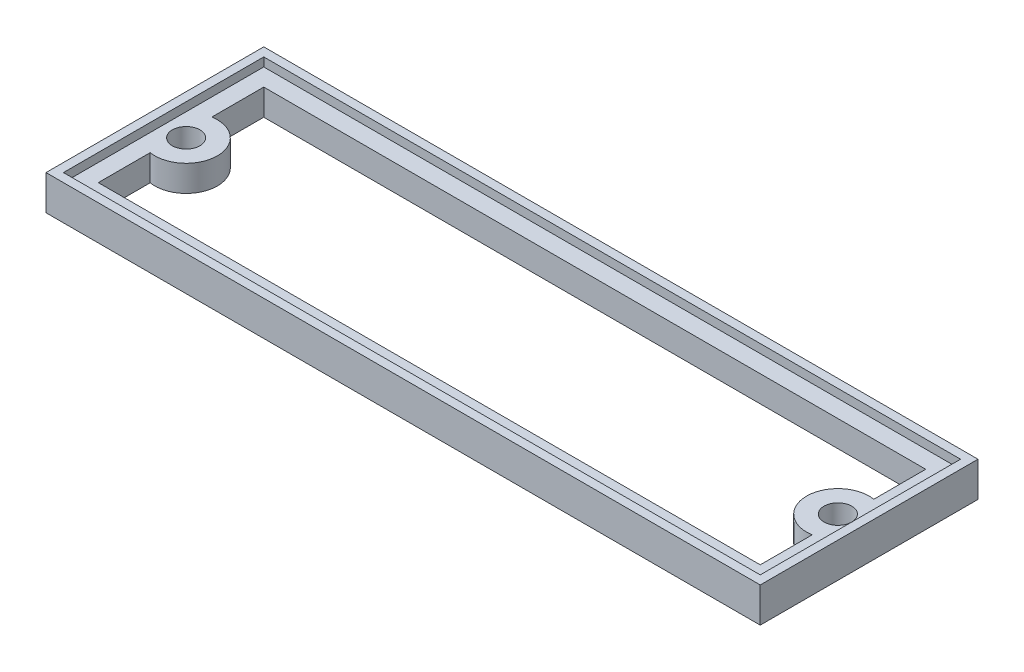
ISO-10303-21;
HEADER;
FILE_DESCRIPTION(('STEP AP214'),'2;1');
FILE_NAME('part.step','',(''),(''),'','','');
FILE_SCHEMA(('AUTOMOTIVE_DESIGN { 1 0 10303 214 1 1 1 1 }'));
ENDSEC;
DATA;
#1=APPLICATION_CONTEXT('core data for automotive mechanical design processes');
#2=APPLICATION_PROTOCOL_DEFINITION('international standard','automotive_design',2000,#1);
#3=PRODUCT_CONTEXT('',#1,'mechanical');
#4=PRODUCT('Part','Part','',(#3));
#5=PRODUCT_RELATED_PRODUCT_CATEGORY('part','',(#4));
#6=PRODUCT_DEFINITION_FORMATION('','',#4);
#7=PRODUCT_DEFINITION_CONTEXT('part definition',#1,'design');
#8=PRODUCT_DEFINITION('design','',#6,#7);
#9=PRODUCT_DEFINITION_SHAPE('','',#8);
#10=(LENGTH_UNIT() NAMED_UNIT(*) SI_UNIT(.MILLI.,.METRE.));
#11=(NAMED_UNIT(*) PLANE_ANGLE_UNIT() SI_UNIT($,.RADIAN.));
#12=(NAMED_UNIT(*) SI_UNIT($,.STERADIAN.) SOLID_ANGLE_UNIT());
#13=UNCERTAINTY_MEASURE_WITH_UNIT(LENGTH_MEASURE(1.E-05),#10,'distance_accuracy_value','');
#14=(GEOMETRIC_REPRESENTATION_CONTEXT(3) GLOBAL_UNCERTAINTY_ASSIGNED_CONTEXT((#13)) GLOBAL_UNIT_ASSIGNED_CONTEXT((#10,
#11,#12)) REPRESENTATION_CONTEXT('',''));
#15=CARTESIAN_POINT('',(0.,0.,0.));
#16=DIRECTION('',(0.,0.,1.));
#17=DIRECTION('',(1.,0.,0.));
#18=AXIS2_PLACEMENT_3D('',#15,#16,#17);
#19=CARTESIAN_POINT('',(2.58750000000001,3.,-11.5));
#20=DIRECTION('',(0.,-1.,0.));
#21=DIRECTION('',(0.,0.,-1.));
#22=AXIS2_PLACEMENT_3D('',#19,#20,#21);
#23=CYLINDRICAL_SURFACE('',#22,3.58750000000001);
#24=CARTESIAN_POINT('',(2.58750000000001,0.,-11.5));
#25=DIRECTION('',(0.,1.,0.));
#26=DIRECTION('',(0.,0.,1.));
#27=AXIS2_PLACEMENT_3D('',#24,#25,#26);
#28=CIRCLE('',#27,3.58750000000001);
#29=CARTESIAN_POINT('',(2.,0.,-15.0390676738373));
#30=VERTEX_POINT('',#29);
#31=CARTESIAN_POINT('',(2.,0.,-7.96093232616271));
#32=VERTEX_POINT('',#31);
#33=EDGE_CURVE('E144',#30,#32,#28,.F.);
#34=ORIENTED_EDGE('',*,*,#33,.F.);
#35=DIRECTION('',(0.,-1.,0.));
#36=VECTOR('',#35,1.);
#37=CARTESIAN_POINT('',(2.,3.,-15.0390676738373));
#38=LINE('',#37,#36);
#39=CARTESIAN_POINT('',(2.,3.,-15.0390676738373));
#40=VERTEX_POINT('',#39);
#41=EDGE_CURVE('E11',#40,#30,#38,.T.);
#42=ORIENTED_EDGE('',*,*,#41,.F.);
#43=CARTESIAN_POINT('',(2.58750000000001,3.,-11.5));
#44=DIRECTION('',(0.,1.,0.));
#45=DIRECTION('',(0.,0.,1.));
#46=AXIS2_PLACEMENT_3D('',#43,#44,#45);
#47=CIRCLE('',#46,3.58750000000001);
#48=CARTESIAN_POINT('',(2.,3.,-7.96093232616271));
#49=VERTEX_POINT('',#48);
#50=EDGE_CURVE('E167',#40,#49,#47,.F.);
#51=ORIENTED_EDGE('',*,*,#50,.T.);
#52=DIRECTION('',(0.,-1.,0.));
#53=VECTOR('',#52,1.);
#54=CARTESIAN_POINT('',(2.,3.,-7.96093232616271));
#55=LINE('',#54,#53);
#56=EDGE_CURVE('E87',#49,#32,#55,.T.);
#57=ORIENTED_EDGE('',*,*,#56,.T.);
#58=EDGE_LOOP('',(#34,#42,#51,#57));
#59=FACE_BOUND('',#58,.T.);
#60=ADVANCED_FACE('F34',(#59),#23,.T.);
#61=CARTESIAN_POINT('',(2.,3.,0.));
#62=DIRECTION('',(-1.,0.,0.));
#63=DIRECTION('',(0.,0.,1.));
#64=AXIS2_PLACEMENT_3D('',#61,#62,#63);
#65=PLANE('',#64);
#66=DIRECTION('',(0.,0.,-1.));
#67=VECTOR('',#66,1.);
#68=CARTESIAN_POINT('',(2.,0.,0.));
#69=LINE('',#68,#67);
#70=CARTESIAN_POINT('',(2.,0.,-21.));
#71=VERTEX_POINT('',#70);
#72=EDGE_CURVE('E148',#30,#71,#69,.T.);
#73=ORIENTED_EDGE('',*,*,#72,.T.);
#74=DIRECTION('',(0.,-1.,0.));
#75=VECTOR('',#74,1.);
#76=CARTESIAN_POINT('',(2.,3.,-21.));
#77=LINE('',#76,#75);
#78=CARTESIAN_POINT('',(2.,3.,-21.));
#79=VERTEX_POINT('',#78);
#80=EDGE_CURVE('E42',#79,#71,#77,.T.);
#81=ORIENTED_EDGE('',*,*,#80,.F.);
#82=DIRECTION('',(0.,0.,-1.));
#83=VECTOR('',#82,1.);
#84=CARTESIAN_POINT('',(2.,3.,0.));
#85=LINE('',#84,#83);
#86=EDGE_CURVE('E169',#40,#79,#85,.T.);
#87=ORIENTED_EDGE('',*,*,#86,.F.);
#88=ORIENTED_EDGE('',*,*,#41,.T.);
#89=EDGE_LOOP('',(#73,#81,#87,#88));
#90=FACE_BOUND('',#89,.T.);
#91=ADVANCED_FACE('F248',(#90),#65,.F.);
#92=CARTESIAN_POINT('',(0.,3.,-21.));
#93=DIRECTION('',(0.,0.,-1.));
#94=DIRECTION('',(-1.,0.,0.));
#95=AXIS2_PLACEMENT_3D('',#92,#93,#94);
#96=PLANE('',#95);
#97=DIRECTION('',(1.,0.,0.));
#98=VECTOR('',#97,1.);
#99=CARTESIAN_POINT('',(0.,0.,-21.));
#100=LINE('',#99,#98);
#101=CARTESIAN_POINT('',(78.,0.,-21.));
#102=VERTEX_POINT('',#101);
#103=EDGE_CURVE('E192',#71,#102,#100,.T.);
#104=ORIENTED_EDGE('',*,*,#103,.T.);
#105=DIRECTION('',(0.,-1.,0.));
#106=VECTOR('',#105,1.);
#107=CARTESIAN_POINT('',(78.,3.,-21.));
#108=LINE('',#107,#106);
#109=CARTESIAN_POINT('',(78.,3.,-21.));
#110=VERTEX_POINT('',#109);
#111=EDGE_CURVE('E219',#110,#102,#108,.T.);
#112=ORIENTED_EDGE('',*,*,#111,.F.);
#113=DIRECTION('',(1.,0.,0.));
#114=VECTOR('',#113,1.);
#115=CARTESIAN_POINT('',(0.,3.,-21.));
#116=LINE('',#115,#114);
#117=EDGE_CURVE('E172',#79,#110,#116,.T.);
#118=ORIENTED_EDGE('',*,*,#117,.F.);
#119=ORIENTED_EDGE('',*,*,#80,.T.);
#120=EDGE_LOOP('',(#104,#112,#118,#119));
#121=FACE_BOUND('',#120,.T.);
#122=ADVANCED_FACE('F226',(#121),#96,.F.);
#123=CARTESIAN_POINT('',(78.0000000000001,3.,-1.81593648406063E-13));
#124=DIRECTION('',(1.,0.,0.));
#125=DIRECTION('',(0.,0.,-1.));
#126=AXIS2_PLACEMENT_3D('',#123,#124,#125);
#127=PLANE('',#126);
#128=DIRECTION('',(0.,0.,1.));
#129=VECTOR('',#128,1.);
#130=CARTESIAN_POINT('',(78.0000000000001,0.,-1.81593648406063E-13));
#131=LINE('',#130,#129);
#132=CARTESIAN_POINT('',(78.,0.,-15.0390676738373));
#133=VERTEX_POINT('',#132);
#134=EDGE_CURVE('E194',#102,#133,#131,.T.);
#135=ORIENTED_EDGE('',*,*,#134,.T.);
#136=DIRECTION('',(0.,-1.,0.));
#137=VECTOR('',#136,1.);
#138=CARTESIAN_POINT('',(78.,3.,-15.0390676738373));
#139=LINE('',#138,#137);
#140=CARTESIAN_POINT('',(78.,3.,-15.0390676738373));
#141=VERTEX_POINT('',#140);
#142=EDGE_CURVE('E216',#141,#133,#139,.T.);
#143=ORIENTED_EDGE('',*,*,#142,.F.);
#144=DIRECTION('',(0.,0.,1.));
#145=VECTOR('',#144,1.);
#146=CARTESIAN_POINT('',(78.0000000000001,3.,-1.81593648406063E-13));
#147=LINE('',#146,#145);
#148=EDGE_CURVE('E174',#110,#141,#147,.T.);
#149=ORIENTED_EDGE('',*,*,#148,.F.);
#150=ORIENTED_EDGE('',*,*,#111,.T.);
#151=EDGE_LOOP('',(#135,#143,#149,#150));
#152=FACE_BOUND('',#151,.T.);
#153=ADVANCED_FACE('F238',(#152),#127,.F.);
#154=CARTESIAN_POINT('',(77.4125,3.,-11.5));
#155=DIRECTION('',(0.,-1.,0.));
#156=DIRECTION('',(0.,0.,-1.));
#157=AXIS2_PLACEMENT_3D('',#154,#155,#156);
#158=CYLINDRICAL_SURFACE('',#157,3.5875);
#159=CARTESIAN_POINT('',(77.4125,0.,-11.5));
#160=DIRECTION('',(0.,1.,0.));
#161=DIRECTION('',(0.,0.,1.));
#162=AXIS2_PLACEMENT_3D('',#159,#160,#161);
#163=CIRCLE('',#162,3.5875);
#164=CARTESIAN_POINT('',(78.,0.,-7.96093232616272));
#165=VERTEX_POINT('',#164);
#166=EDGE_CURVE('E196',#133,#165,#163,.T.);
#167=ORIENTED_EDGE('',*,*,#166,.T.);
#168=DIRECTION('',(0.,-1.,0.));
#169=VECTOR('',#168,1.);
#170=CARTESIAN_POINT('',(78.,3.,-7.96093232616272));
#171=LINE('',#170,#169);
#172=CARTESIAN_POINT('',(78.,3.,-7.96093232616272));
#173=VERTEX_POINT('',#172);
#174=EDGE_CURVE('E213',#173,#165,#171,.T.);
#175=ORIENTED_EDGE('',*,*,#174,.F.);
#176=CARTESIAN_POINT('',(77.4125,3.,-11.5));
#177=DIRECTION('',(0.,1.,0.));
#178=DIRECTION('',(0.,0.,1.));
#179=AXIS2_PLACEMENT_3D('',#176,#177,#178);
#180=CIRCLE('',#179,3.5875);
#181=EDGE_CURVE('E176',#141,#173,#180,.T.);
#182=ORIENTED_EDGE('',*,*,#181,.F.);
#183=ORIENTED_EDGE('',*,*,#142,.T.);
#184=EDGE_LOOP('',(#167,#175,#182,#183));
#185=FACE_BOUND('',#184,.T.);
#186=ADVANCED_FACE('F242',(#185),#158,.T.);
#187=CARTESIAN_POINT('',(78.,3.,1.81593648406063E-13));
#188=DIRECTION('',(1.,0.,0.));
#189=DIRECTION('',(0.,0.,-1.));
#190=AXIS2_PLACEMENT_3D('',#187,#188,#189);
#191=PLANE('',#190);
#192=DIRECTION('',(0.,0.,1.));
#193=VECTOR('',#192,1.);
#194=CARTESIAN_POINT('',(78.,0.,1.81593648406063E-13));
#195=LINE('',#194,#193);
#196=CARTESIAN_POINT('',(78.,0.,-2.));
#197=VERTEX_POINT('',#196);
#198=EDGE_CURVE('E198',#165,#197,#195,.T.);
#199=ORIENTED_EDGE('',*,*,#198,.T.);
#200=DIRECTION('',(0.,-1.,0.));
#201=VECTOR('',#200,1.);
#202=CARTESIAN_POINT('',(78.,3.,-2.));
#203=LINE('',#202,#201);
#204=CARTESIAN_POINT('',(78.,3.,-2.));
#205=VERTEX_POINT('',#204);
#206=EDGE_CURVE('E211',#205,#197,#203,.T.);
#207=ORIENTED_EDGE('',*,*,#206,.F.);
#208=DIRECTION('',(0.,0.,1.));
#209=VECTOR('',#208,1.);
#210=CARTESIAN_POINT('',(78.,3.,1.81593648406063E-13));
#211=LINE('',#210,#209);
#212=EDGE_CURVE('E178',#173,#205,#211,.T.);
#213=ORIENTED_EDGE('',*,*,#212,.F.);
#214=ORIENTED_EDGE('',*,*,#174,.T.);
#215=EDGE_LOOP('',(#199,#207,#213,#214));
#216=FACE_BOUND('',#215,.T.);
#217=ADVANCED_FACE('F260',(#216),#191,.F.);
#218=CARTESIAN_POINT('',(0.,3.,-2.));
#219=DIRECTION('',(0.,0.,1.));
#220=DIRECTION('',(1.,0.,0.));
#221=AXIS2_PLACEMENT_3D('',#218,#219,#220);
#222=PLANE('',#221);
#223=DIRECTION('',(-1.,0.,0.));
#224=VECTOR('',#223,1.);
#225=CARTESIAN_POINT('',(0.,0.,-2.));
#226=LINE('',#225,#224);
#227=CARTESIAN_POINT('',(2.,0.,-2.));
#228=VERTEX_POINT('',#227);
#229=EDGE_CURVE('E79',#197,#228,#226,.T.);
#230=ORIENTED_EDGE('',*,*,#229,.T.);
#231=DIRECTION('',(0.,-1.,0.));
#232=VECTOR('',#231,1.);
#233=CARTESIAN_POINT('',(2.,3.,-2.));
#234=LINE('',#233,#232);
#235=CARTESIAN_POINT('',(2.,3.,-2.));
#236=VERTEX_POINT('',#235);
#237=EDGE_CURVE('E209',#236,#228,#234,.T.);
#238=ORIENTED_EDGE('',*,*,#237,.F.);
#239=DIRECTION('',(-1.,0.,0.));
#240=VECTOR('',#239,1.);
#241=CARTESIAN_POINT('',(0.,3.,-2.));
#242=LINE('',#241,#240);
#243=EDGE_CURVE('E180',#205,#236,#242,.T.);
#244=ORIENTED_EDGE('',*,*,#243,.F.);
#245=ORIENTED_EDGE('',*,*,#206,.T.);
#246=EDGE_LOOP('',(#230,#238,#244,#245));
#247=FACE_BOUND('',#246,.T.);
#248=ADVANCED_FACE('F263',(#247),#222,.F.);
#249=CARTESIAN_POINT('',(77.4125,3.,-11.5));
#250=DIRECTION('',(0.,-1.,0.));
#251=DIRECTION('',(0.,0.,-1.));
#252=AXIS2_PLACEMENT_3D('',#249,#250,#251);
#253=CYLINDRICAL_SURFACE('',#252,1.5875);
#254=CARTESIAN_POINT('',(77.4125,3.,-11.5));
#255=DIRECTION('',(0.,1.,0.));
#256=DIRECTION('',(0.,0.,1.));
#257=AXIS2_PLACEMENT_3D('',#254,#255,#256);
#258=CIRCLE('',#257,1.5875);
#259=CARTESIAN_POINT('',(77.4125,3.,-9.9125));
#260=VERTEX_POINT('',#259);
#261=EDGE_CURVE('E185',#260,#260,#258,.T.);
#262=ORIENTED_EDGE('',*,*,#261,.T.);
#263=EDGE_LOOP('',(#262));
#264=FACE_BOUND('',#263,.T.);
#265=CARTESIAN_POINT('',(77.4125,0.,-11.5));
#266=DIRECTION('',(0.,1.,0.));
#267=DIRECTION('',(0.,0.,1.));
#268=AXIS2_PLACEMENT_3D('',#265,#266,#267);
#269=CIRCLE('',#268,1.5875);
#270=CARTESIAN_POINT('',(77.4125,0.,-9.9125));
#271=VERTEX_POINT('',#270);
#272=EDGE_CURVE('E203',#271,#271,#269,.T.);
#273=ORIENTED_EDGE('',*,*,#272,.F.);
#274=EDGE_LOOP('',(#273));
#275=FACE_BOUND('',#274,.T.);
#276=ADVANCED_FACE('F267',(#264,#275),#253,.F.);
#277=CARTESIAN_POINT('',(2.,3.,0.));
#278=DIRECTION('',(-1.,0.,0.));
#279=DIRECTION('',(0.,0.,1.));
#280=AXIS2_PLACEMENT_3D('',#277,#278,#279);
#281=PLANE('',#280);
#282=DIRECTION('',(0.,0.,-1.));
#283=VECTOR('',#282,1.);
#284=CARTESIAN_POINT('',(2.,0.,0.));
#285=LINE('',#284,#283);
#286=EDGE_CURVE('E201',#228,#32,#285,.T.);
#287=ORIENTED_EDGE('',*,*,#286,.T.);
#288=ORIENTED_EDGE('',*,*,#56,.F.);
#289=DIRECTION('',(0.,0.,-1.));
#290=VECTOR('',#289,1.);
#291=CARTESIAN_POINT('',(2.,3.,0.));
#292=LINE('',#291,#290);
#293=EDGE_CURVE('E126',#236,#49,#292,.T.);
#294=ORIENTED_EDGE('',*,*,#293,.F.);
#295=ORIENTED_EDGE('',*,*,#237,.T.);
#296=EDGE_LOOP('',(#287,#288,#294,#295));
#297=FACE_BOUND('',#296,.T.);
#298=ADVANCED_FACE('F268',(#297),#281,.F.);
#299=CARTESIAN_POINT('',(2.58750000000001,3.,-11.5));
#300=DIRECTION('',(0.,-1.,0.));
#301=DIRECTION('',(0.,0.,-1.));
#302=AXIS2_PLACEMENT_3D('',#299,#300,#301);
#303=CYLINDRICAL_SURFACE('',#302,1.5875);
#304=CARTESIAN_POINT('',(2.58750000000001,3.,-11.5));
#305=DIRECTION('',(0.,1.,0.));
#306=DIRECTION('',(0.,0.,1.));
#307=AXIS2_PLACEMENT_3D('',#304,#305,#306);
#308=CIRCLE('',#307,1.5875);
#309=CARTESIAN_POINT('',(2.58750000000001,3.,-9.91249999999999));
#310=VERTEX_POINT('',#309);
#311=EDGE_CURVE('E188',#310,#310,#308,.F.);
#312=ORIENTED_EDGE('',*,*,#311,.F.);
#313=EDGE_LOOP('',(#312));
#314=FACE_BOUND('',#313,.T.);
#315=CARTESIAN_POINT('',(2.58750000000001,0.,-11.5));
#316=DIRECTION('',(0.,1.,0.));
#317=DIRECTION('',(0.,0.,1.));
#318=AXIS2_PLACEMENT_3D('',#315,#316,#317);
#319=CIRCLE('',#318,1.5875);
#320=CARTESIAN_POINT('',(2.58750000000001,0.,-9.91249999999999));
#321=VERTEX_POINT('',#320);
#322=EDGE_CURVE('E170',#321,#321,#319,.F.);
#323=ORIENTED_EDGE('',*,*,#322,.T.);
#324=EDGE_LOOP('',(#323));
#325=FACE_BOUND('',#324,.T.);
#326=ADVANCED_FACE('F271',(#314,#325),#303,.F.);
#327=CARTESIAN_POINT('',(0.,3.,0.));
#328=DIRECTION('',(0.,1.,0.));
#329=DIRECTION('',(0.,0.,1.));
#330=AXIS2_PLACEMENT_3D('',#327,#328,#329);
#331=PLANE('',#330);
#332=ORIENTED_EDGE('',*,*,#50,.F.);
#333=ORIENTED_EDGE('',*,*,#86,.T.);
#334=ORIENTED_EDGE('',*,*,#117,.T.);
#335=ORIENTED_EDGE('',*,*,#148,.T.);
#336=ORIENTED_EDGE('',*,*,#181,.T.);
#337=ORIENTED_EDGE('',*,*,#212,.T.);
#338=ORIENTED_EDGE('',*,*,#243,.T.);
#339=ORIENTED_EDGE('',*,*,#293,.T.);
#340=EDGE_LOOP('',(#332,#333,#334,#335,#336,#337,#338,#339));
#341=FACE_BOUND('',#340,.T.);
#342=DIRECTION('',(-1.,0.,0.));
#343=VECTOR('',#342,1.);
#344=CARTESIAN_POINT('',(0.,3.,0.));
#345=LINE('',#344,#343);
#346=CARTESIAN_POINT('',(80.,3.,0.));
#347=VERTEX_POINT('',#346);
#348=CARTESIAN_POINT('',(0.,3.,0.));
#349=VERTEX_POINT('',#348);
#350=EDGE_CURVE('E116',#347,#349,#345,.T.);
#351=ORIENTED_EDGE('',*,*,#350,.F.);
#352=DIRECTION('',(0.,0.,1.));
#353=VECTOR('',#352,1.);
#354=CARTESIAN_POINT('',(80.,3.,0.));
#355=LINE('',#354,#353);
#356=CARTESIAN_POINT('',(80.,3.,-23.));
#357=VERTEX_POINT('',#356);
#358=EDGE_CURVE('E120',#357,#347,#355,.T.);
#359=ORIENTED_EDGE('',*,*,#358,.F.);
#360=DIRECTION('',(1.,0.,0.));
#361=VECTOR('',#360,1.);
#362=CARTESIAN_POINT('',(0.,3.,-23.));
#363=LINE('',#362,#361);
#364=CARTESIAN_POINT('',(0.,3.,-23.));
#365=VERTEX_POINT('',#364);
#366=EDGE_CURVE('E137',#365,#357,#363,.T.);
#367=ORIENTED_EDGE('',*,*,#366,.F.);
#368=DIRECTION('',(0.,0.,-1.));
#369=VECTOR('',#368,1.);
#370=CARTESIAN_POINT('',(0.,3.,0.));
#371=LINE('',#370,#369);
#372=EDGE_CURVE('E50',#349,#365,#371,.T.);
#373=ORIENTED_EDGE('',*,*,#372,.F.);
#374=EDGE_LOOP('',(#351,#359,#367,#373));
#375=FACE_BOUND('',#374,.T.);
#376=ORIENTED_EDGE('',*,*,#261,.F.);
#377=EDGE_LOOP('',(#376));
#378=FACE_BOUND('',#377,.T.);
#379=ORIENTED_EDGE('',*,*,#311,.T.);
#380=EDGE_LOOP('',(#379));
#381=FACE_BOUND('',#380,.T.);
#382=ADVANCED_FACE('F118',(#341,#375,#378,#381),#331,.T.);
#383=CARTESIAN_POINT('',(0.,0.,0.));
#384=DIRECTION('',(0.,1.,0.));
#385=DIRECTION('',(0.,0.,1.));
#386=AXIS2_PLACEMENT_3D('',#383,#384,#385);
#387=PLANE('',#386);
#388=ORIENTED_EDGE('',*,*,#33,.T.);
#389=ORIENTED_EDGE('',*,*,#286,.F.);
#390=ORIENTED_EDGE('',*,*,#229,.F.);
#391=ORIENTED_EDGE('',*,*,#198,.F.);
#392=ORIENTED_EDGE('',*,*,#166,.F.);
#393=ORIENTED_EDGE('',*,*,#134,.F.);
#394=ORIENTED_EDGE('',*,*,#103,.F.);
#395=ORIENTED_EDGE('',*,*,#72,.F.);
#396=EDGE_LOOP('',(#388,#389,#390,#391,#392,#393,#394,#395));
#397=FACE_BOUND('',#396,.T.);
#398=ORIENTED_EDGE('',*,*,#272,.T.);
#399=EDGE_LOOP('',(#398));
#400=FACE_BOUND('',#399,.T.);
#401=ORIENTED_EDGE('',*,*,#322,.F.);
#402=EDGE_LOOP('',(#401));
#403=FACE_BOUND('',#402,.T.);
#404=DIRECTION('',(0.,0.,-1.));
#405=VECTOR('',#404,1.);
#406=CARTESIAN_POINT('',(-1.,0.,0.));
#407=LINE('',#406,#405);
#408=CARTESIAN_POINT('',(-1.,0.,1.));
#409=VERTEX_POINT('',#408);
#410=CARTESIAN_POINT('',(-1.00000000000001,0.,-24.));
#411=VERTEX_POINT('',#410);
#412=EDGE_CURVE('E343',#409,#411,#407,.T.);
#413=ORIENTED_EDGE('',*,*,#412,.T.);
#414=DIRECTION('',(1.,0.,0.));
#415=VECTOR('',#414,1.);
#416=CARTESIAN_POINT('',(0.,0.,-24.));
#417=LINE('',#416,#415);
#418=CARTESIAN_POINT('',(81.,0.,-24.));
#419=VERTEX_POINT('',#418);
#420=EDGE_CURVE('E352',#411,#419,#417,.T.);
#421=ORIENTED_EDGE('',*,*,#420,.T.);
#422=DIRECTION('',(0.,0.,1.));
#423=VECTOR('',#422,1.);
#424=CARTESIAN_POINT('',(81.,0.,0.));
#425=LINE('',#424,#423);
#426=CARTESIAN_POINT('',(81.,0.,0.999999999999991));
#427=VERTEX_POINT('',#426);
#428=EDGE_CURVE('E349',#419,#427,#425,.T.);
#429=ORIENTED_EDGE('',*,*,#428,.T.);
#430=DIRECTION('',(-1.,0.,0.));
#431=VECTOR('',#430,1.);
#432=CARTESIAN_POINT('',(0.,0.,1.));
#433=LINE('',#432,#431);
#434=EDGE_CURVE('E346',#427,#409,#433,.T.);
#435=ORIENTED_EDGE('',*,*,#434,.T.);
#436=EDGE_LOOP('',(#413,#421,#429,#435));
#437=FACE_BOUND('',#436,.T.);
#438=ADVANCED_FACE('F232',(#397,#400,#403,#437),#387,.F.);
#439=CARTESIAN_POINT('',(80.,4.,0.));
#440=DIRECTION('',(1.,0.,0.));
#441=DIRECTION('',(0.,0.,-1.));
#442=AXIS2_PLACEMENT_3D('',#439,#440,#441);
#443=PLANE('',#442);
#444=ORIENTED_EDGE('',*,*,#358,.T.);
#445=DIRECTION('',(0.,-1.,0.));
#446=VECTOR('',#445,1.);
#447=CARTESIAN_POINT('',(80.,4.,0.));
#448=LINE('',#447,#446);
#449=CARTESIAN_POINT('',(80.,4.,0.));
#450=VERTEX_POINT('',#449);
#451=EDGE_CURVE('E134',#450,#347,#448,.T.);
#452=ORIENTED_EDGE('',*,*,#451,.F.);
#453=DIRECTION('',(0.,0.,1.));
#454=VECTOR('',#453,1.);
#455=CARTESIAN_POINT('',(80.,4.,0.));
#456=LINE('',#455,#454);
#457=CARTESIAN_POINT('',(80.,4.,-23.));
#458=VERTEX_POINT('',#457);
#459=EDGE_CURVE('E325',#458,#450,#456,.T.);
#460=ORIENTED_EDGE('',*,*,#459,.F.);
#461=DIRECTION('',(0.,-1.,0.));
#462=VECTOR('',#461,1.);
#463=CARTESIAN_POINT('',(80.,4.,-23.));
#464=LINE('',#463,#462);
#465=EDGE_CURVE('E136',#458,#357,#464,.T.);
#466=ORIENTED_EDGE('',*,*,#465,.T.);
#467=EDGE_LOOP('',(#444,#452,#460,#466));
#468=FACE_BOUND('',#467,.T.);
#469=ADVANCED_FACE('F131',(#468),#443,.F.);
#470=CARTESIAN_POINT('',(0.,4.,0.));
#471=DIRECTION('',(0.,0.,1.));
#472=DIRECTION('',(1.,0.,0.));
#473=AXIS2_PLACEMENT_3D('',#470,#471,#472);
#474=PLANE('',#473);
#475=ORIENTED_EDGE('',*,*,#350,.T.);
#476=DIRECTION('',(0.,-1.,0.));
#477=VECTOR('',#476,1.);
#478=CARTESIAN_POINT('',(0.,4.,0.));
#479=LINE('',#478,#477);
#480=CARTESIAN_POINT('',(0.,4.,0.));
#481=VERTEX_POINT('',#480);
#482=EDGE_CURVE('E145',#481,#349,#479,.T.);
#483=ORIENTED_EDGE('',*,*,#482,.F.);
#484=DIRECTION('',(-1.,0.,0.));
#485=VECTOR('',#484,1.);
#486=CARTESIAN_POINT('',(0.,4.,0.));
#487=LINE('',#486,#485);
#488=EDGE_CURVE('E142',#450,#481,#487,.T.);
#489=ORIENTED_EDGE('',*,*,#488,.F.);
#490=ORIENTED_EDGE('',*,*,#451,.T.);
#491=EDGE_LOOP('',(#475,#483,#489,#490));
#492=FACE_BOUND('',#491,.T.);
#493=ADVANCED_FACE('F140',(#492),#474,.F.);
#494=CARTESIAN_POINT('',(0.,4.,0.));
#495=DIRECTION('',(-1.,0.,0.));
#496=DIRECTION('',(0.,0.,1.));
#497=AXIS2_PLACEMENT_3D('',#494,#495,#496);
#498=PLANE('',#497);
#499=ORIENTED_EDGE('',*,*,#372,.T.);
#500=DIRECTION('',(0.,-1.,0.));
#501=VECTOR('',#500,1.);
#502=CARTESIAN_POINT('',(0.,4.,-23.));
#503=LINE('',#502,#501);
#504=CARTESIAN_POINT('',(0.,4.,-23.));
#505=VERTEX_POINT('',#504);
#506=EDGE_CURVE('E150',#505,#365,#503,.T.);
#507=ORIENTED_EDGE('',*,*,#506,.F.);
#508=DIRECTION('',(0.,0.,-1.));
#509=VECTOR('',#508,1.);
#510=CARTESIAN_POINT('',(0.,4.,0.));
#511=LINE('',#510,#509);
#512=EDGE_CURVE('E334',#481,#505,#511,.T.);
#513=ORIENTED_EDGE('',*,*,#512,.F.);
#514=ORIENTED_EDGE('',*,*,#482,.T.);
#515=EDGE_LOOP('',(#499,#507,#513,#514));
#516=FACE_BOUND('',#515,.T.);
#517=ADVANCED_FACE('F287',(#516),#498,.F.);
#518=CARTESIAN_POINT('',(-1.,4.,0.));
#519=DIRECTION('',(-1.,0.,0.));
#520=DIRECTION('',(0.,0.,1.));
#521=AXIS2_PLACEMENT_3D('',#518,#519,#520);
#522=PLANE('',#521);
#523=ORIENTED_EDGE('',*,*,#412,.F.);
#524=DIRECTION('',(0.,-1.,0.));
#525=VECTOR('',#524,1.);
#526=CARTESIAN_POINT('',(-1.,4.,1.));
#527=LINE('',#526,#525);
#528=CARTESIAN_POINT('',(-1.,4.,1.));
#529=VERTEX_POINT('',#528);
#530=EDGE_CURVE('E164',#529,#409,#527,.T.);
#531=ORIENTED_EDGE('',*,*,#530,.F.);
#532=DIRECTION('',(0.,0.,-1.));
#533=VECTOR('',#532,1.);
#534=CARTESIAN_POINT('',(-1.,4.,0.));
#535=LINE('',#534,#533);
#536=CARTESIAN_POINT('',(-1.00000000000001,4.,-24.));
#537=VERTEX_POINT('',#536);
#538=EDGE_CURVE('E322',#529,#537,#535,.T.);
#539=ORIENTED_EDGE('',*,*,#538,.T.);
#540=DIRECTION('',(0.,-1.,0.));
#541=VECTOR('',#540,1.);
#542=CARTESIAN_POINT('',(-1.00000000000001,4.,-24.));
#543=LINE('',#542,#541);
#544=EDGE_CURVE('E154',#537,#411,#543,.T.);
#545=ORIENTED_EDGE('',*,*,#544,.T.);
#546=EDGE_LOOP('',(#523,#531,#539,#545));
#547=FACE_BOUND('',#546,.T.);
#548=ADVANCED_FACE('F283',(#547),#522,.T.);
#549=CARTESIAN_POINT('',(0.,4.,1.));
#550=DIRECTION('',(0.,0.,1.));
#551=DIRECTION('',(1.,0.,0.));
#552=AXIS2_PLACEMENT_3D('',#549,#550,#551);
#553=PLANE('',#552);
#554=ORIENTED_EDGE('',*,*,#434,.F.);
#555=DIRECTION('',(0.,-1.,0.));
#556=VECTOR('',#555,1.);
#557=CARTESIAN_POINT('',(81.,4.,0.999999999999991));
#558=LINE('',#557,#556);
#559=CARTESIAN_POINT('',(81.,4.,0.999999999999991));
#560=VERTEX_POINT('',#559);
#561=EDGE_CURVE('E161',#560,#427,#558,.T.);
#562=ORIENTED_EDGE('',*,*,#561,.F.);
#563=DIRECTION('',(-1.,0.,0.));
#564=VECTOR('',#563,1.);
#565=CARTESIAN_POINT('',(0.,4.,1.));
#566=LINE('',#565,#564);
#567=EDGE_CURVE('E381',#560,#529,#566,.T.);
#568=ORIENTED_EDGE('',*,*,#567,.T.);
#569=ORIENTED_EDGE('',*,*,#530,.T.);
#570=EDGE_LOOP('',(#554,#562,#568,#569));
#571=FACE_BOUND('',#570,.T.);
#572=ADVANCED_FACE('F286',(#571),#553,.T.);
#573=CARTESIAN_POINT('',(81.,4.,0.));
#574=DIRECTION('',(1.,0.,0.));
#575=DIRECTION('',(0.,0.,-1.));
#576=AXIS2_PLACEMENT_3D('',#573,#574,#575);
#577=PLANE('',#576);
#578=ORIENTED_EDGE('',*,*,#428,.F.);
#579=DIRECTION('',(0.,-1.,0.));
#580=VECTOR('',#579,1.);
#581=CARTESIAN_POINT('',(81.,4.,-24.));
#582=LINE('',#581,#580);
#583=CARTESIAN_POINT('',(81.,4.,-24.));
#584=VERTEX_POINT('',#583);
#585=EDGE_CURVE('E157',#584,#419,#582,.T.);
#586=ORIENTED_EDGE('',*,*,#585,.F.);
#587=DIRECTION('',(0.,0.,1.));
#588=VECTOR('',#587,1.);
#589=CARTESIAN_POINT('',(81.,4.,0.));
#590=LINE('',#589,#588);
#591=EDGE_CURVE('E337',#584,#560,#590,.T.);
#592=ORIENTED_EDGE('',*,*,#591,.T.);
#593=ORIENTED_EDGE('',*,*,#561,.T.);
#594=EDGE_LOOP('',(#578,#586,#592,#593));
#595=FACE_BOUND('',#594,.T.);
#596=ADVANCED_FACE('F291',(#595),#577,.T.);
#597=CARTESIAN_POINT('',(0.,4.,-24.));
#598=DIRECTION('',(0.,0.,-1.));
#599=DIRECTION('',(-1.,0.,0.));
#600=AXIS2_PLACEMENT_3D('',#597,#598,#599);
#601=PLANE('',#600);
#602=ORIENTED_EDGE('',*,*,#420,.F.);
#603=ORIENTED_EDGE('',*,*,#544,.F.);
#604=DIRECTION('',(1.,0.,0.));
#605=VECTOR('',#604,1.);
#606=CARTESIAN_POINT('',(0.,4.,-24.));
#607=LINE('',#606,#605);
#608=EDGE_CURVE('E332',#537,#584,#607,.T.);
#609=ORIENTED_EDGE('',*,*,#608,.T.);
#610=ORIENTED_EDGE('',*,*,#585,.T.);
#611=EDGE_LOOP('',(#602,#603,#609,#610));
#612=FACE_BOUND('',#611,.T.);
#613=ADVANCED_FACE('F295',(#612),#601,.T.);
#614=CARTESIAN_POINT('',(0.,4.,-23.));
#615=DIRECTION('',(0.,0.,-1.));
#616=DIRECTION('',(-1.,0.,0.));
#617=AXIS2_PLACEMENT_3D('',#614,#615,#616);
#618=PLANE('',#617);
#619=ORIENTED_EDGE('',*,*,#366,.T.);
#620=ORIENTED_EDGE('',*,*,#465,.F.);
#621=DIRECTION('',(1.,0.,0.));
#622=VECTOR('',#621,1.);
#623=CARTESIAN_POINT('',(0.,4.,-23.));
#624=LINE('',#623,#622);
#625=EDGE_CURVE('E158',#505,#458,#624,.T.);
#626=ORIENTED_EDGE('',*,*,#625,.F.);
#627=ORIENTED_EDGE('',*,*,#506,.T.);
#628=EDGE_LOOP('',(#619,#620,#626,#627));
#629=FACE_BOUND('',#628,.T.);
#630=ADVANCED_FACE('F299',(#629),#618,.F.);
#631=CARTESIAN_POINT('',(0.,4.,0.));
#632=DIRECTION('',(0.,1.,0.));
#633=DIRECTION('',(0.,0.,1.));
#634=AXIS2_PLACEMENT_3D('',#631,#632,#633);
#635=PLANE('',#634);
#636=ORIENTED_EDGE('',*,*,#538,.F.);
#637=ORIENTED_EDGE('',*,*,#567,.F.);
#638=ORIENTED_EDGE('',*,*,#591,.F.);
#639=ORIENTED_EDGE('',*,*,#608,.F.);
#640=EDGE_LOOP('',(#636,#637,#638,#639));
#641=FACE_BOUND('',#640,.T.);
#642=ORIENTED_EDGE('',*,*,#459,.T.);
#643=ORIENTED_EDGE('',*,*,#488,.T.);
#644=ORIENTED_EDGE('',*,*,#512,.T.);
#645=ORIENTED_EDGE('',*,*,#625,.T.);
#646=EDGE_LOOP('',(#642,#643,#644,#645));
#647=FACE_BOUND('',#646,.T.);
#648=ADVANCED_FACE('F310',(#641,#647),#635,.T.);
#649=CLOSED_SHELL('',(#60,#91,#122,#153,#186,#217,#248,#276,#298,#326,#382,#438,#469,#493,#517,
#548,#572,#596,#613,#630,#648));
#650=MANIFOLD_SOLID_BREP('B2',#649);
#651=ADVANCED_BREP_SHAPE_REPRESENTATION('',(#18,#650),#14);
#652=SHAPE_DEFINITION_REPRESENTATION(#9,#651);
ENDSEC;
END-ISO-10303-21;
